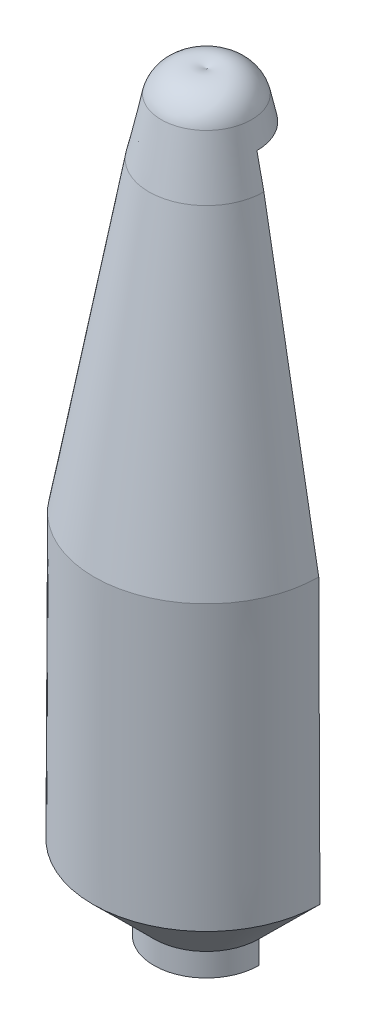
ISO-10303-21;
HEADER;
FILE_DESCRIPTION(('STEP AP214'),'2;1');
FILE_NAME('part.step','',(''),(''),'','','');
FILE_SCHEMA(('AUTOMOTIVE_DESIGN { 1 0 10303 214 1 1 1 1 }'));
ENDSEC;
DATA;
#1=APPLICATION_CONTEXT('core data for automotive mechanical design processes');
#2=APPLICATION_PROTOCOL_DEFINITION('international standard','automotive_design',2000,#1);
#3=PRODUCT_CONTEXT('',#1,'mechanical');
#4=PRODUCT('Part','Part','',(#3));
#5=PRODUCT_RELATED_PRODUCT_CATEGORY('part','',(#4));
#6=PRODUCT_DEFINITION_FORMATION('','',#4);
#7=PRODUCT_DEFINITION_CONTEXT('part definition',#1,'design');
#8=PRODUCT_DEFINITION('design','',#6,#7);
#9=PRODUCT_DEFINITION_SHAPE('','',#8);
#10=(LENGTH_UNIT() NAMED_UNIT(*) SI_UNIT(.MILLI.,.METRE.));
#11=(NAMED_UNIT(*) PLANE_ANGLE_UNIT() SI_UNIT($,.RADIAN.));
#12=(NAMED_UNIT(*) SI_UNIT($,.STERADIAN.) SOLID_ANGLE_UNIT());
#13=UNCERTAINTY_MEASURE_WITH_UNIT(LENGTH_MEASURE(1.E-05),#10,'distance_accuracy_value','');
#14=(GEOMETRIC_REPRESENTATION_CONTEXT(3) GLOBAL_UNCERTAINTY_ASSIGNED_CONTEXT((#13)) GLOBAL_UNIT_ASSIGNED_CONTEXT((#10,
#11,#12)) REPRESENTATION_CONTEXT('',''));
#15=CARTESIAN_POINT('',(0.,0.,0.));
#16=DIRECTION('',(0.,0.,1.));
#17=DIRECTION('',(1.,0.,0.));
#18=AXIS2_PLACEMENT_3D('',#15,#16,#17);
#19=CARTESIAN_POINT('',(0.,5386.324,-888.999999999999));
#20=DIRECTION('',(0.,-1.,0.));
#21=DIRECTION('',(0.,0.,-1.));
#22=AXIS2_PLACEMENT_3D('',#19,#20,#21);
#23=PLANE('',#22);
#24=DIRECTION('',(-1.,0.,0.));
#25=VECTOR('',#24,1.);
#26=CARTESIAN_POINT('',(0.,5386.324,0.));
#27=LINE('',#26,#25);
#28=CARTESIAN_POINT('',(888.999999999999,5386.324,0.));
#29=VERTEX_POINT('',#28);
#30=CARTESIAN_POINT('',(-888.999999999999,5386.324,0.));
#31=VERTEX_POINT('',#30);
#32=EDGE_CURVE('E143',#29,#31,#27,.T.);
#33=ORIENTED_EDGE('',*,*,#32,.F.);
#34=CARTESIAN_POINT('',(0.,5386.324,0.));
#35=DIRECTION('',(0.,-1.,0.));
#36=DIRECTION('',(0.,0.,-1.));
#37=AXIS2_PLACEMENT_3D('',#34,#35,#36);
#38=CIRCLE('',#37,888.999999999999);
#39=EDGE_CURVE('E133',#29,#31,#38,.T.);
#40=ORIENTED_EDGE('',*,*,#39,.T.);
#41=EDGE_LOOP('',(#33,#40));
#42=FACE_BOUND('',#41,.T.);
#43=ADVANCED_FACE('F30',(#42),#23,.T.);
#44=CARTESIAN_POINT('',(0.,6251.49278915406,-236.037368649495));
#45=DIRECTION('',(-1.,0.,0.));
#46=DIRECTION('',(0.,0.,-1.));
#47=AXIS2_PLACEMENT_3D('',#44,#45,#46);
#48=CIRCLE('',#47,581.857436344019);
#49=TRIMMED_CURVE('',#48,(PARAMETER_VALUE(-1.98849915610744)),
(PARAMETER_VALUE(1.98849915610744)),.T.,.PARAMETER.);
#50=CARTESIAN_POINT('',(0.,6251.49278915406,0.));
#51=DIRECTION('',(0.,-1.,0.));
#52=AXIS1_PLACEMENT('',#50,#51);
#53=SURFACE_OF_REVOLUTION('',#49,#52);
#54=CARTESIAN_POINT('',(0.,6783.324,0.));
#55=VERTEX_POINT('',#54);
#56=VERTEX_LOOP('',#55);
#57=FACE_BOUND('',#56,.T.);
#58=CARTESIAN_POINT('',(0.,6403.50518283522,0.));
#59=DIRECTION('',(0.,-1.,0.));
#60=DIRECTION('',(0.,0.,-1.));
#61=AXIS2_PLACEMENT_3D('',#58,#59,#60);
#62=CIRCLE('',#61,797.687000000001);
#63=CARTESIAN_POINT('',(0.,6403.50518283522,-797.687000000001));
#64=VERTEX_POINT('',#63);
#65=EDGE_CURVE('E201',#64,#64,#62,.T.);
#66=ORIENTED_EDGE('',*,*,#65,.F.);
#67=EDGE_LOOP('',(#66));
#68=FACE_BOUND('',#67,.T.);
#69=ADVANCED_FACE('F218',(#57,#68),#53,.T.);
#70=CARTESIAN_POINT('',(0.,5408.72489867263,0.));
#71=DIRECTION('',(0.,-1.,0.));
#72=DIRECTION('',(0.,0.,-1.));
#73=AXIS2_PLACEMENT_3D('',#70,#71,#72);
#74=CONICAL_SURFACE('',#73,1014.00879864497,0.214123281670925);
#75=DIRECTION('',(-0.212490813305486,-0.977163064314638,0.));
#76=VECTOR('',#75,1.);
#77=CARTESIAN_POINT('',(0.,10071.7591706599,0.));
#78=LINE('',#77,#76);
#79=CARTESIAN_POINT('',(-1014.00879864497,5408.72489867263,0.));
#80=VERTEX_POINT('',#79);
#81=CARTESIAN_POINT('',(-890.403977494229,5977.13566392335,0.));
#82=VERTEX_POINT('',#81);
#83=EDGE_CURVE('E122',#80,#82,#78,.F.);
#84=ORIENTED_EDGE('',*,*,#83,.F.);
#85=CARTESIAN_POINT('',(0.,5408.72489867263,0.));
#86=DIRECTION('',(0.,-1.,0.));
#87=DIRECTION('',(0.,0.,-1.));
#88=AXIS2_PLACEMENT_3D('',#85,#86,#87);
#89=CIRCLE('',#88,1014.00879864497);
#90=CARTESIAN_POINT('',(1014.00879864497,5408.72489867263,0.));
#91=VERTEX_POINT('',#90);
#92=EDGE_CURVE('E141',#91,#80,#89,.T.);
#93=ORIENTED_EDGE('',*,*,#92,.F.);
#94=DIRECTION('',(-0.212490813305486,0.977163064314638,0.));
#95=VECTOR('',#94,1.);
#96=CARTESIAN_POINT('',(0.,10071.7591706599,0.));
#97=LINE('',#96,#95);
#98=CARTESIAN_POINT('',(890.403977494229,5977.13566392335,0.));
#99=VERTEX_POINT('',#98);
#100=EDGE_CURVE('E140',#99,#91,#97,.F.);
#101=ORIENTED_EDGE('',*,*,#100,.F.);
#102=CARTESIAN_POINT('',(0.,5977.13566392335,0.));
#103=DIRECTION('',(0.,1.,0.));
#104=DIRECTION('',(0.,0.,1.));
#105=AXIS2_PLACEMENT_3D('',#102,#103,#104);
#106=CIRCLE('',#105,890.40397749423);
#107=EDGE_CURVE('E11',#82,#99,#106,.F.);
#108=ORIENTED_EDGE('',*,*,#107,.F.);
#109=EDGE_LOOP('',(#84,#93,#101,#108));
#110=FACE_BOUND('',#109,.T.);
#111=ORIENTED_EDGE('',*,*,#65,.T.);
#112=EDGE_LOOP('',(#111));
#113=FACE_BOUND('',#112,.T.);
#114=ADVANCED_FACE('F138',(#110,#113),#74,.T.);
#115=CARTESIAN_POINT('',(0.,11.2892016348477,0.));
#116=DIRECTION('',(0.,-1.,0.));
#117=DIRECTION('',(0.,0.,-1.));
#118=AXIS2_PLACEMENT_3D('',#115,#116,#117);
#119=CONICAL_SURFACE('',#118,1981.2,0.177312681615657);
#120=DIRECTION('',(-0.176385028918344,-0.98432124917299,0.));
#121=VECTOR('',#120,1.);
#122=CARTESIAN_POINT('',(0.,11067.4274171085,0.));
#123=LINE('',#122,#121);
#124=CARTESIAN_POINT('',(-1981.2,11.2892016348383,0.));
#125=VERTEX_POINT('',#124);
#126=EDGE_CURVE('E128',#125,#80,#123,.F.);
#127=ORIENTED_EDGE('',*,*,#126,.F.);
#128=CARTESIAN_POINT('',(0.,11.2892016348477,0.));
#129=DIRECTION('',(0.,-1.,0.));
#130=DIRECTION('',(0.,0.,-1.));
#131=AXIS2_PLACEMENT_3D('',#128,#129,#130);
#132=CIRCLE('',#131,1981.2);
#133=CARTESIAN_POINT('',(1981.2,11.2892016348383,0.));
#134=VERTEX_POINT('',#133);
#135=EDGE_CURVE('E197',#134,#125,#132,.T.);
#136=ORIENTED_EDGE('',*,*,#135,.F.);
#137=DIRECTION('',(-0.176385028918344,0.98432124917299,0.));
#138=VECTOR('',#137,1.);
#139=CARTESIAN_POINT('',(0.,11067.4274171085,0.));
#140=LINE('',#139,#138);
#141=EDGE_CURVE('E144',#91,#134,#140,.F.);
#142=ORIENTED_EDGE('',*,*,#141,.F.);
#143=ORIENTED_EDGE('',*,*,#92,.T.);
#144=EDGE_LOOP('',(#127,#136,#142,#143));
#145=FACE_BOUND('',#144,.T.);
#146=ADVANCED_FACE('F225',(#145),#119,.T.);
#147=CARTESIAN_POINT('',(0.,-4978.03097816896,0.));
#148=DIRECTION('',(0.,-1.,0.));
#149=DIRECTION('',(0.,0.,-1.));
#150=AXIS2_PLACEMENT_3D('',#147,#148,#149);
#151=CONICAL_SURFACE('',#150,2002.028,0.00417449236843432);
#152=DIRECTION('',(-0.00417448024405862,-0.999991286819386,0.));
#153=VECTOR('',#152,1.);
#154=CARTESIAN_POINT('',(0.,474605.159963464,0.));
#155=LINE('',#154,#153);
#156=CARTESIAN_POINT('',(-2002.028,-4978.03097816896,0.));
#157=VERTEX_POINT('',#156);
#158=EDGE_CURVE('E165',#157,#125,#155,.F.);
#159=ORIENTED_EDGE('',*,*,#158,.F.);
#160=CARTESIAN_POINT('',(0.,-4978.03097816896,0.));
#161=DIRECTION('',(0.,-1.,0.));
#162=DIRECTION('',(0.,0.,-1.));
#163=AXIS2_PLACEMENT_3D('',#160,#161,#162);
#164=CIRCLE('',#163,2002.028);
#165=CARTESIAN_POINT('',(2002.028,-4978.03097816896,0.));
#166=VERTEX_POINT('',#165);
#167=EDGE_CURVE('E194',#166,#157,#164,.T.);
#168=ORIENTED_EDGE('',*,*,#167,.F.);
#169=DIRECTION('',(-0.00417448024405862,0.999991286819386,0.));
#170=VECTOR('',#169,1.);
#171=CARTESIAN_POINT('',(0.,474605.159963464,0.));
#172=LINE('',#171,#170);
#173=EDGE_CURVE('E148',#134,#166,#172,.F.);
#174=ORIENTED_EDGE('',*,*,#173,.F.);
#175=ORIENTED_EDGE('',*,*,#135,.T.);
#176=EDGE_LOOP('',(#159,#168,#174,#175));
#177=FACE_BOUND('',#176,.T.);
#178=ADVANCED_FACE('F231',(#177),#151,.T.);
#179=CARTESIAN_POINT('',(0.,-6044.83097816896,0.));
#180=DIRECTION('',(0.,1.,0.));
#181=DIRECTION('',(0.,0.,1.));
#182=AXIS2_PLACEMENT_3D('',#179,#180,#181);
#183=CONICAL_SURFACE('',#182,924.687000000001,0.790314311673033);
#184=DIRECTION('',(0.710574464124136,0.703622008563332,0.));
#185=VECTOR('',#184,1.);
#186=CARTESIAN_POINT('',(0.,-6960.47058679799,0.));
#187=LINE('',#186,#185);
#188=CARTESIAN_POINT('',(924.687000000001,-6044.83097816896,0.));
#189=VERTEX_POINT('',#188);
#190=EDGE_CURVE('E388',#166,#189,#187,.F.);
#191=ORIENTED_EDGE('',*,*,#190,.F.);
#192=ORIENTED_EDGE('',*,*,#167,.T.);
#193=DIRECTION('',(0.710574464124136,-0.703622008563332,0.));
#194=VECTOR('',#193,1.);
#195=CARTESIAN_POINT('',(0.,-6960.47058679799,0.));
#196=LINE('',#195,#194);
#197=CARTESIAN_POINT('',(-924.687000000001,-6044.83097816896,0.));
#198=VERTEX_POINT('',#197);
#199=EDGE_CURVE('E163',#198,#157,#196,.F.);
#200=ORIENTED_EDGE('',*,*,#199,.F.);
#201=CARTESIAN_POINT('',(0.,-6044.83097816896,0.));
#202=DIRECTION('',(0.,-1.,0.));
#203=DIRECTION('',(0.,0.,-1.));
#204=AXIS2_PLACEMENT_3D('',#201,#202,#203);
#205=CIRCLE('',#204,924.687000000001);
#206=EDGE_CURVE('E191',#189,#198,#205,.T.);
#207=ORIENTED_EDGE('',*,*,#206,.F.);
#208=EDGE_LOOP('',(#191,#192,#200,#207));
#209=FACE_BOUND('',#208,.T.);
#210=ADVANCED_FACE('F235',(#209),#183,.T.);
#211=CARTESIAN_POINT('',(0.,0.,0.));
#212=DIRECTION('',(0.,-1.,0.));
#213=DIRECTION('',(0.,0.,-1.));
#214=AXIS2_PLACEMENT_3D('',#211,#212,#213);
#215=CYLINDRICAL_SURFACE('',#214,924.687000000001);
#216=DIRECTION('',(0.,-1.,0.));
#217=VECTOR('',#216,1.);
#218=CARTESIAN_POINT('',(-924.687000000001,0.,0.));
#219=LINE('',#218,#217);
#220=CARTESIAN_POINT('',(-924.687000000001,-6450.58555960543,0.));
#221=VERTEX_POINT('',#220);
#222=EDGE_CURVE('E161',#221,#198,#219,.F.);
#223=ORIENTED_EDGE('',*,*,#222,.F.);
#224=CARTESIAN_POINT('',(0.,-6450.58555960543,0.));
#225=DIRECTION('',(0.,-1.,0.));
#226=DIRECTION('',(0.,0.,-1.));
#227=AXIS2_PLACEMENT_3D('',#224,#225,#226);
#228=CIRCLE('',#227,924.687000000001);
#229=CARTESIAN_POINT('',(924.687000000001,-6450.58555960543,0.));
#230=VERTEX_POINT('',#229);
#231=EDGE_CURVE('E188',#230,#221,#228,.T.);
#232=ORIENTED_EDGE('',*,*,#231,.F.);
#233=DIRECTION('',(0.,-1.,0.));
#234=VECTOR('',#233,1.);
#235=CARTESIAN_POINT('',(924.687000000001,0.,0.));
#236=LINE('',#235,#234);
#237=EDGE_CURVE('E387',#189,#230,#236,.T.);
#238=ORIENTED_EDGE('',*,*,#237,.F.);
#239=ORIENTED_EDGE('',*,*,#206,.T.);
#240=EDGE_LOOP('',(#223,#232,#238,#239));
#241=FACE_BOUND('',#240,.T.);
#242=ADVANCED_FACE('F239',(#241),#215,.T.);
#243=CARTESIAN_POINT('',(0.,-6450.58555960543,-797.687000000001));
#244=DIRECTION('',(0.,-1.,0.));
#245=DIRECTION('',(0.,0.,-1.));
#246=AXIS2_PLACEMENT_3D('',#243,#244,#245);
#247=PLANE('',#246);
#248=DIRECTION('',(-1.,0.,0.));
#249=VECTOR('',#248,1.);
#250=CARTESIAN_POINT('',(0.,-6450.58555960543,0.));
#251=LINE('',#250,#249);
#252=CARTESIAN_POINT('',(797.687000000001,-6450.58555960543,0.));
#253=VERTEX_POINT('',#252);
#254=EDGE_CURVE('E384',#230,#253,#251,.T.);
#255=ORIENTED_EDGE('',*,*,#254,.F.);
#256=ORIENTED_EDGE('',*,*,#231,.T.);
#257=CARTESIAN_POINT('',(-797.687000000001,-6450.58555960543,0.));
#258=VERTEX_POINT('',#257);
#259=EDGE_CURVE('E160',#258,#221,#251,.T.);
#260=ORIENTED_EDGE('',*,*,#259,.F.);
#261=CARTESIAN_POINT('',(0.,-6450.58555960543,0.));
#262=DIRECTION('',(0.,-1.,0.));
#263=DIRECTION('',(0.,0.,-1.));
#264=AXIS2_PLACEMENT_3D('',#261,#262,#263);
#265=CIRCLE('',#264,797.687000000001);
#266=EDGE_CURVE('E185',#253,#258,#265,.T.);
#267=ORIENTED_EDGE('',*,*,#266,.F.);
#268=EDGE_LOOP('',(#255,#256,#260,#267));
#269=FACE_BOUND('',#268,.T.);
#270=ADVANCED_FACE('F243',(#269),#247,.T.);
#271=CARTESIAN_POINT('',(0.,0.,0.));
#272=DIRECTION('',(0.,-1.,0.));
#273=DIRECTION('',(0.,0.,-1.));
#274=AXIS2_PLACEMENT_3D('',#271,#272,#273);
#275=CYLINDRICAL_SURFACE('',#274,797.687000000001);
#276=DIRECTION('',(0.,-1.,0.));
#277=VECTOR('',#276,1.);
#278=CARTESIAN_POINT('',(-797.687000000001,0.,0.));
#279=LINE('',#278,#277);
#280=CARTESIAN_POINT('',(-797.687000000001,-5991.859746,0.));
#281=VERTEX_POINT('',#280);
#282=EDGE_CURVE('E158',#281,#258,#279,.T.);
#283=ORIENTED_EDGE('',*,*,#282,.F.);
#284=CARTESIAN_POINT('',(0.,-5991.859746,0.));
#285=DIRECTION('',(0.,-1.,0.));
#286=DIRECTION('',(0.,0.,-1.));
#287=AXIS2_PLACEMENT_3D('',#284,#285,#286);
#288=CIRCLE('',#287,797.687000000001);
#289=CARTESIAN_POINT('',(797.687000000001,-5991.859746,0.));
#290=VERTEX_POINT('',#289);
#291=EDGE_CURVE('E182',#290,#281,#288,.T.);
#292=ORIENTED_EDGE('',*,*,#291,.F.);
#293=DIRECTION('',(0.,-1.,0.));
#294=VECTOR('',#293,1.);
#295=CARTESIAN_POINT('',(797.687000000001,0.,0.));
#296=LINE('',#295,#294);
#297=EDGE_CURVE('E377',#253,#290,#296,.F.);
#298=ORIENTED_EDGE('',*,*,#297,.F.);
#299=ORIENTED_EDGE('',*,*,#266,.T.);
#300=EDGE_LOOP('',(#283,#292,#298,#299));
#301=FACE_BOUND('',#300,.T.);
#302=ADVANCED_FACE('F247',(#301),#275,.F.);
#303=CARTESIAN_POINT('',(0.,-4925.059746,0.));
#304=DIRECTION('',(0.,1.,0.));
#305=DIRECTION('',(0.,0.,1.));
#306=AXIS2_PLACEMENT_3D('',#303,#304,#305);
#307=CONICAL_SURFACE('',#306,1875.028,0.790314311673033);
#308=DIRECTION('',(0.710574464124136,0.703622008563332,0.));
#309=VECTOR('',#308,1.);
#310=CARTESIAN_POINT('',(0.,-6781.74195748179,0.));
#311=LINE('',#310,#309);
#312=CARTESIAN_POINT('',(1875.028,-4925.059746,0.));
#313=VERTEX_POINT('',#312);
#314=EDGE_CURVE('E375',#290,#313,#311,.T.);
#315=ORIENTED_EDGE('',*,*,#314,.F.);
#316=ORIENTED_EDGE('',*,*,#291,.T.);
#317=DIRECTION('',(0.710574464124136,-0.703622008563332,0.));
#318=VECTOR('',#317,1.);
#319=CARTESIAN_POINT('',(0.,-6781.74195748179,0.));
#320=LINE('',#319,#318);
#321=CARTESIAN_POINT('',(-1875.028,-4925.059746,0.));
#322=VERTEX_POINT('',#321);
#323=EDGE_CURVE('E156',#322,#281,#320,.T.);
#324=ORIENTED_EDGE('',*,*,#323,.F.);
#325=CARTESIAN_POINT('',(0.,-4925.059746,0.));
#326=DIRECTION('',(0.,-1.,0.));
#327=DIRECTION('',(0.,0.,-1.));
#328=AXIS2_PLACEMENT_3D('',#325,#326,#327);
#329=CIRCLE('',#328,1875.028);
#330=EDGE_CURVE('E179',#313,#322,#329,.T.);
#331=ORIENTED_EDGE('',*,*,#330,.F.);
#332=EDGE_LOOP('',(#315,#316,#324,#331));
#333=FACE_BOUND('',#332,.T.);
#334=ADVANCED_FACE('F251',(#333),#307,.F.);
#335=CARTESIAN_POINT('',(0.,0.,0.));
#336=DIRECTION('',(0.,-1.,0.));
#337=DIRECTION('',(0.,0.,-1.));
#338=AXIS2_PLACEMENT_3D('',#335,#336,#337);
#339=CYLINDRICAL_SURFACE('',#338,1875.028);
#340=DIRECTION('',(0.,-1.,0.));
#341=VECTOR('',#340,1.);
#342=CARTESIAN_POINT('',(-1875.028,0.,0.));
#343=LINE('',#342,#341);
#344=CARTESIAN_POINT('',(-1875.028,-914.399745999999,0.));
#345=VERTEX_POINT('',#344);
#346=EDGE_CURVE('E154',#345,#322,#343,.T.);
#347=ORIENTED_EDGE('',*,*,#346,.F.);
#348=CARTESIAN_POINT('',(0.,-914.399745999999,0.));
#349=DIRECTION('',(0.,-1.,0.));
#350=DIRECTION('',(0.,0.,-1.));
#351=AXIS2_PLACEMENT_3D('',#348,#349,#350);
#352=CIRCLE('',#351,1875.028);
#353=CARTESIAN_POINT('',(1875.028,-914.399745999999,0.));
#354=VERTEX_POINT('',#353);
#355=EDGE_CURVE('E176',#354,#345,#352,.T.);
#356=ORIENTED_EDGE('',*,*,#355,.F.);
#357=DIRECTION('',(0.,-1.,0.));
#358=VECTOR('',#357,1.);
#359=CARTESIAN_POINT('',(1875.028,0.,0.));
#360=LINE('',#359,#358);
#361=EDGE_CURVE('E366',#313,#354,#360,.F.);
#362=ORIENTED_EDGE('',*,*,#361,.F.);
#363=ORIENTED_EDGE('',*,*,#330,.T.);
#364=EDGE_LOOP('',(#347,#356,#362,#363));
#365=FACE_BOUND('',#364,.T.);
#366=ADVANCED_FACE('F255',(#365),#339,.F.);
#367=CARTESIAN_POINT('',(0.,-914.399745999999,-1854.2));
#368=DIRECTION('',(0.,-1.,0.));
#369=DIRECTION('',(0.,0.,-1.));
#370=AXIS2_PLACEMENT_3D('',#367,#368,#369);
#371=PLANE('',#370);
#372=DIRECTION('',(-1.,0.,0.));
#373=VECTOR('',#372,1.);
#374=CARTESIAN_POINT('',(0.,-914.399745999999,0.));
#375=LINE('',#374,#373);
#376=CARTESIAN_POINT('',(1854.2,-914.399745999999,0.));
#377=VERTEX_POINT('',#376);
#378=EDGE_CURVE('E364',#354,#377,#375,.T.);
#379=ORIENTED_EDGE('',*,*,#378,.F.);
#380=ORIENTED_EDGE('',*,*,#355,.T.);
#381=CARTESIAN_POINT('',(-1854.2,-914.399745999999,0.));
#382=VERTEX_POINT('',#381);
#383=EDGE_CURVE('E153',#382,#345,#375,.T.);
#384=ORIENTED_EDGE('',*,*,#383,.F.);
#385=CARTESIAN_POINT('',(0.,-914.399745999999,0.));
#386=DIRECTION('',(0.,-1.,0.));
#387=DIRECTION('',(0.,0.,-1.));
#388=AXIS2_PLACEMENT_3D('',#385,#386,#387);
#389=CIRCLE('',#388,1854.2);
#390=EDGE_CURVE('E173',#377,#382,#389,.T.);
#391=ORIENTED_EDGE('',*,*,#390,.F.);
#392=EDGE_LOOP('',(#379,#380,#384,#391));
#393=FACE_BOUND('',#392,.T.);
#394=ADVANCED_FACE('F259',(#393),#371,.T.);
#395=CARTESIAN_POINT('',(0.,0.,0.));
#396=DIRECTION('',(0.,-1.,0.));
#397=DIRECTION('',(0.,0.,-1.));
#398=AXIS2_PLACEMENT_3D('',#395,#396,#397);
#399=CYLINDRICAL_SURFACE('',#398,1854.2);
#400=DIRECTION('',(0.,-1.,0.));
#401=VECTOR('',#400,1.);
#402=CARTESIAN_POINT('',(-1854.2,0.,0.));
#403=LINE('',#402,#401);
#404=CARTESIAN_POINT('',(-1854.2,0.000254000001476129,0.));
#405=VERTEX_POINT('',#404);
#406=EDGE_CURVE('E146',#405,#382,#403,.T.);
#407=ORIENTED_EDGE('',*,*,#406,.F.);
#408=CARTESIAN_POINT('',(0.,0.00025400000060056,0.));
#409=DIRECTION('',(0.,-1.,0.));
#410=DIRECTION('',(0.,0.,-1.));
#411=AXIS2_PLACEMENT_3D('',#408,#409,#410);
#412=CIRCLE('',#411,1854.2);
#413=CARTESIAN_POINT('',(1854.2,0.00025400000060056,0.));
#414=VERTEX_POINT('',#413);
#415=EDGE_CURVE('E170',#414,#405,#412,.T.);
#416=ORIENTED_EDGE('',*,*,#415,.F.);
#417=DIRECTION('',(0.,-1.,0.));
#418=VECTOR('',#417,1.);
#419=CARTESIAN_POINT('',(1854.2,0.,0.));
#420=LINE('',#419,#418);
#421=EDGE_CURVE('E44',#377,#414,#420,.F.);
#422=ORIENTED_EDGE('',*,*,#421,.F.);
#423=ORIENTED_EDGE('',*,*,#390,.T.);
#424=EDGE_LOOP('',(#407,#416,#422,#423));
#425=FACE_BOUND('',#424,.T.);
#426=ADVANCED_FACE('F213',(#425),#399,.F.);
#427=CARTESIAN_POINT('',(0.,5386.324,0.));
#428=DIRECTION('',(0.,-1.,0.));
#429=DIRECTION('',(0.,0.,-1.));
#430=AXIS2_PLACEMENT_3D('',#427,#428,#429);
#431=CONICAL_SURFACE('',#430,888.999999999999,0.177312681615657);
#432=DIRECTION('',(-0.176385028918344,-0.98432124917299,0.));
#433=VECTOR('',#432,1.);
#434=CARTESIAN_POINT('',(0.,10347.4116607895,0.));
#435=LINE('',#434,#433);
#436=EDGE_CURVE('E37',#31,#405,#435,.T.);
#437=ORIENTED_EDGE('',*,*,#436,.F.);
#438=ORIENTED_EDGE('',*,*,#39,.F.);
#439=DIRECTION('',(-0.176385028918344,0.98432124917299,0.));
#440=VECTOR('',#439,1.);
#441=CARTESIAN_POINT('',(0.,10347.4116607895,0.));
#442=LINE('',#441,#440);
#443=EDGE_CURVE('E204',#414,#29,#442,.T.);
#444=ORIENTED_EDGE('',*,*,#443,.F.);
#445=ORIENTED_EDGE('',*,*,#415,.T.);
#446=EDGE_LOOP('',(#437,#438,#444,#445));
#447=FACE_BOUND('',#446,.T.);
#448=ADVANCED_FACE('F215',(#447),#431,.F.);
#449=CARTESIAN_POINT('',(-2540.,5977.13566392335,0.));
#450=DIRECTION('',(0.,0.,1.));
#451=DIRECTION('',(1.,0.,0.));
#452=AXIS2_PLACEMENT_3D('',#449,#450,#451);
#453=PLANE('',#452);
#454=ORIENTED_EDGE('',*,*,#83,.T.);
#455=DIRECTION('',(1.,0.,0.));
#456=VECTOR('',#455,1.);
#457=CARTESIAN_POINT('',(-2540.,5977.13566392335,0.));
#458=LINE('',#457,#456);
#459=EDGE_CURVE('E125',#82,#99,#458,.T.);
#460=ORIENTED_EDGE('',*,*,#459,.T.);
#461=ORIENTED_EDGE('',*,*,#100,.T.);
#462=ORIENTED_EDGE('',*,*,#141,.T.);
#463=ORIENTED_EDGE('',*,*,#173,.T.);
#464=ORIENTED_EDGE('',*,*,#190,.T.);
#465=ORIENTED_EDGE('',*,*,#237,.T.);
#466=ORIENTED_EDGE('',*,*,#254,.T.);
#467=ORIENTED_EDGE('',*,*,#297,.T.);
#468=ORIENTED_EDGE('',*,*,#314,.T.);
#469=ORIENTED_EDGE('',*,*,#361,.T.);
#470=ORIENTED_EDGE('',*,*,#378,.T.);
#471=ORIENTED_EDGE('',*,*,#421,.T.);
#472=ORIENTED_EDGE('',*,*,#443,.T.);
#473=ORIENTED_EDGE('',*,*,#32,.T.);
#474=ORIENTED_EDGE('',*,*,#436,.T.);
#475=ORIENTED_EDGE('',*,*,#406,.T.);
#476=ORIENTED_EDGE('',*,*,#383,.T.);
#477=ORIENTED_EDGE('',*,*,#346,.T.);
#478=ORIENTED_EDGE('',*,*,#323,.T.);
#479=ORIENTED_EDGE('',*,*,#282,.T.);
#480=ORIENTED_EDGE('',*,*,#259,.T.);
#481=ORIENTED_EDGE('',*,*,#222,.T.);
#482=ORIENTED_EDGE('',*,*,#199,.T.);
#483=ORIENTED_EDGE('',*,*,#158,.T.);
#484=ORIENTED_EDGE('',*,*,#126,.T.);
#485=EDGE_LOOP('',(#454,#460,#461,#462,#463,#464,#465,#466,#467,#468,#469,#470,#471,#472,#473,
#474,#475,#476,#477,#478,#479,#480,#481,#482,#483,#484));
#486=FACE_BOUND('',#485,.T.);
#487=ADVANCED_FACE('F124',(#486),#453,.F.);
#488=CARTESIAN_POINT('',(-2540.,5977.13566392335,0.));
#489=DIRECTION('',(0.,1.,0.));
#490=DIRECTION('',(0.,0.,1.));
#491=AXIS2_PLACEMENT_3D('',#488,#489,#490);
#492=PLANE('',#491);
#493=ORIENTED_EDGE('',*,*,#107,.T.);
#494=ORIENTED_EDGE('',*,*,#459,.F.);
#495=EDGE_LOOP('',(#493,#494));
#496=FACE_BOUND('',#495,.T.);
#497=ADVANCED_FACE('F136',(#496),#492,.F.);
#498=CLOSED_SHELL('',(#43,#69,#114,#146,#178,#210,#242,#270,#302,#334,#366,#394,#426,#448,#487,#497));
#499=MANIFOLD_SOLID_BREP('B2',#498);
#500=ADVANCED_BREP_SHAPE_REPRESENTATION('',(#18,#499),#14);
#501=SHAPE_DEFINITION_REPRESENTATION(#9,#500);
ENDSEC;
END-ISO-10303-21;
